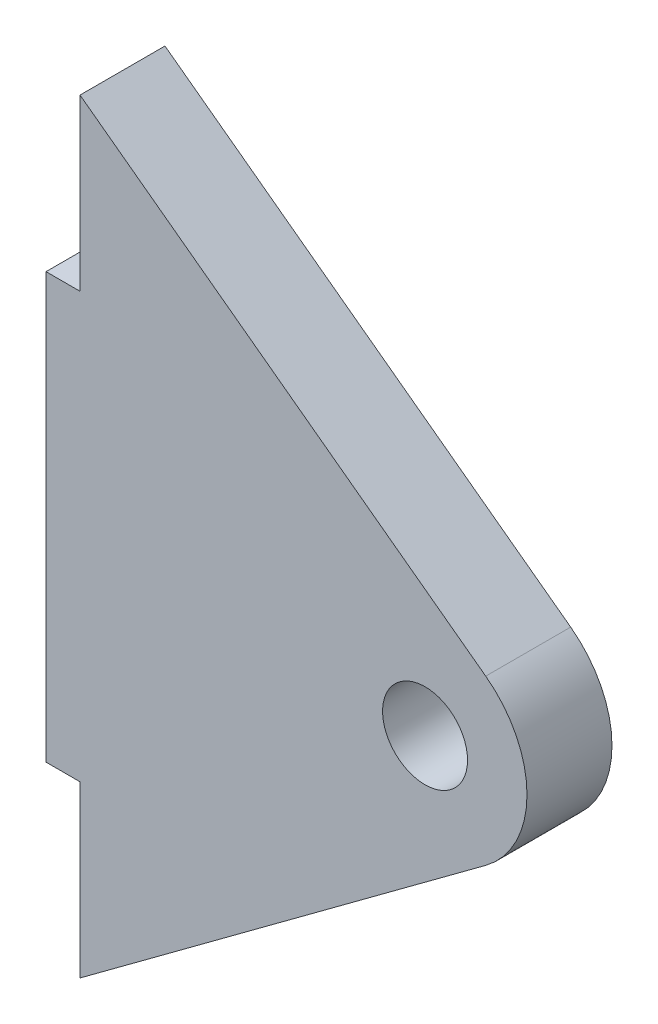
ISO-10303-21;
HEADER;
FILE_DESCRIPTION(('STEP AP214'),'2;1');
FILE_NAME('part.step','',(''),(''),'','','');
FILE_SCHEMA(('AUTOMOTIVE_DESIGN { 1 0 10303 214 1 1 1 1 }'));
ENDSEC;
DATA;
#1=APPLICATION_CONTEXT('core data for automotive mechanical design processes');
#2=APPLICATION_PROTOCOL_DEFINITION('international standard','automotive_design',2000,#1);
#3=PRODUCT_CONTEXT('',#1,'mechanical');
#4=PRODUCT('Part','Part','',(#3));
#5=PRODUCT_RELATED_PRODUCT_CATEGORY('part','',(#4));
#6=PRODUCT_DEFINITION_FORMATION('','',#4);
#7=PRODUCT_DEFINITION_CONTEXT('part definition',#1,'design');
#8=PRODUCT_DEFINITION('design','',#6,#7);
#9=PRODUCT_DEFINITION_SHAPE('','',#8);
#10=(LENGTH_UNIT() NAMED_UNIT(*) SI_UNIT(.MILLI.,.METRE.));
#11=(NAMED_UNIT(*) PLANE_ANGLE_UNIT() SI_UNIT($,.RADIAN.));
#12=(NAMED_UNIT(*) SI_UNIT($,.STERADIAN.) SOLID_ANGLE_UNIT());
#13=UNCERTAINTY_MEASURE_WITH_UNIT(LENGTH_MEASURE(1.E-05),#10,'distance_accuracy_value','');
#14=(GEOMETRIC_REPRESENTATION_CONTEXT(3) GLOBAL_UNCERTAINTY_ASSIGNED_CONTEXT((#13)) GLOBAL_UNIT_ASSIGNED_CONTEXT((#10,
#11,#12)) REPRESENTATION_CONTEXT('',''));
#15=CARTESIAN_POINT('',(0.,0.,0.));
#16=DIRECTION('',(0.,0.,1.));
#17=DIRECTION('',(1.,0.,0.));
#18=AXIS2_PLACEMENT_3D('',#15,#16,#17);
#19=CARTESIAN_POINT('',(210.781303050667,212.057553234732,-5.));
#20=DIRECTION('',(0.,0.,1.));
#21=DIRECTION('',(-1.,0.,0.));
#22=AXIS2_PLACEMENT_3D('',#19,#20,#21);
#23=CYLINDRICAL_SURFACE('',#22,6.);
#24=CARTESIAN_POINT('',(210.781303050667,212.057553234732,0.));
#25=DIRECTION('',(0.,0.,1.));
#26=DIRECTION('',(1.,0.,0.));
#27=AXIS2_PLACEMENT_3D('',#24,#25,#26);
#28=CIRCLE('',#27,6.);
#29=CARTESIAN_POINT('',(214.351594971474,216.879691308265,0.));
#30=VERTEX_POINT('',#29);
#31=CARTESIAN_POINT('',(214.351594971474,207.235415161199,0.));
#32=VERTEX_POINT('',#31);
#33=EDGE_CURVE('E140',#30,#32,#28,.F.);
#34=ORIENTED_EDGE('',*,*,#33,.T.);
#35=DIRECTION('',(0.,0.,1.));
#36=VECTOR('',#35,1.);
#37=CARTESIAN_POINT('',(214.351594971474,207.235415161199,-5.));
#38=LINE('',#37,#36);
#39=CARTESIAN_POINT('',(214.351594971474,207.235415161199,-5.));
#40=VERTEX_POINT('',#39);
#41=EDGE_CURVE('E139',#40,#32,#38,.T.);
#42=ORIENTED_EDGE('',*,*,#41,.F.);
#43=CARTESIAN_POINT('',(210.781303050667,212.057553234732,-5.));
#44=DIRECTION('',(0.,0.,1.));
#45=DIRECTION('',(1.,0.,0.));
#46=AXIS2_PLACEMENT_3D('',#43,#44,#45);
#47=CIRCLE('',#46,6.);
#48=CARTESIAN_POINT('',(214.351594971474,216.879691308265,-5.));
#49=VERTEX_POINT('',#48);
#50=EDGE_CURVE('E159',#49,#40,#47,.F.);
#51=ORIENTED_EDGE('',*,*,#50,.F.);
#52=DIRECTION('',(0.,0.,1.));
#53=VECTOR('',#52,1.);
#54=CARTESIAN_POINT('',(214.351594971474,216.879691308265,-5.));
#55=LINE('',#54,#53);
#56=EDGE_CURVE('E11',#49,#30,#55,.T.);
#57=ORIENTED_EDGE('',*,*,#56,.T.);
#58=EDGE_LOOP('',(#34,#42,#51,#57));
#59=FACE_BOUND('',#58,.T.);
#60=ADVANCED_FACE('F39',(#59),#23,.T.);
#61=CARTESIAN_POINT('',(179.617576694411,242.596620799026,-5.));
#62=DIRECTION('',(0.595048653467869,0.803689678922204,0.));
#63=DIRECTION('',(-0.803689678922204,0.595048653467869,0.));
#64=AXIS2_PLACEMENT_3D('',#61,#62,#63);
#65=PLANE('',#64);
#66=DIRECTION('',(0.803689678922204,-0.595048653467869,0.));
#67=VECTOR('',#66,1.);
#68=CARTESIAN_POINT('',(179.617576694411,242.596620799026,0.));
#69=LINE('',#68,#67);
#70=CARTESIAN_POINT('',(190.475370577193,234.557553234732,0.));
#71=VERTEX_POINT('',#70);
#72=EDGE_CURVE('E143',#71,#30,#69,.T.);
#73=ORIENTED_EDGE('',*,*,#72,.T.);
#74=ORIENTED_EDGE('',*,*,#56,.F.);
#75=DIRECTION('',(0.803689678922204,-0.595048653467869,0.));
#76=VECTOR('',#75,1.);
#77=CARTESIAN_POINT('',(179.617576694411,242.596620799026,-5.));
#78=LINE('',#77,#76);
#79=CARTESIAN_POINT('',(190.475370577193,234.557553234732,-5.));
#80=VERTEX_POINT('',#79);
#81=EDGE_CURVE('E93',#80,#49,#78,.T.);
#82=ORIENTED_EDGE('',*,*,#81,.F.);
#83=DIRECTION('',(0.,0.,1.));
#84=VECTOR('',#83,1.);
#85=CARTESIAN_POINT('',(190.475370577193,234.557553234732,-5.));
#86=LINE('',#85,#84);
#87=EDGE_CURVE('E47',#80,#71,#86,.T.);
#88=ORIENTED_EDGE('',*,*,#87,.T.);
#89=EDGE_LOOP('',(#73,#74,#82,#88));
#90=FACE_BOUND('',#89,.T.);
#91=ADVANCED_FACE('F172',(#90),#65,.T.);
#92=CARTESIAN_POINT('',(190.475370577193,0.,-5.));
#93=DIRECTION('',(-1.,0.,0.));
#94=DIRECTION('',(0.,0.,-1.));
#95=AXIS2_PLACEMENT_3D('',#92,#93,#94);
#96=PLANE('',#95);
#97=DIRECTION('',(0.,1.,0.));
#98=VECTOR('',#97,1.);
#99=CARTESIAN_POINT('',(190.475370577193,0.,0.));
#100=LINE('',#99,#98);
#101=CARTESIAN_POINT('',(190.475370577193,224.557553234732,0.));
#102=VERTEX_POINT('',#101);
#103=EDGE_CURVE('E145',#102,#71,#100,.T.);
#104=ORIENTED_EDGE('',*,*,#103,.T.);
#105=ORIENTED_EDGE('',*,*,#87,.F.);
#106=DIRECTION('',(0.,1.,0.));
#107=VECTOR('',#106,1.);
#108=CARTESIAN_POINT('',(190.475370577193,0.,-5.));
#109=LINE('',#108,#107);
#110=CARTESIAN_POINT('',(190.475370577193,224.557553234732,-5.));
#111=VERTEX_POINT('',#110);
#112=EDGE_CURVE('E116',#111,#80,#109,.T.);
#113=ORIENTED_EDGE('',*,*,#112,.F.);
#114=DIRECTION('',(0.,0.,1.));
#115=VECTOR('',#114,1.);
#116=CARTESIAN_POINT('',(190.475370577193,224.557553234732,-5.));
#117=LINE('',#116,#115);
#118=EDGE_CURVE('E166',#111,#102,#117,.T.);
#119=ORIENTED_EDGE('',*,*,#118,.T.);
#120=EDGE_LOOP('',(#104,#105,#113,#119));
#121=FACE_BOUND('',#120,.T.);
#122=ADVANCED_FACE('F190',(#121),#96,.T.);
#123=CARTESIAN_POINT('',(0.,224.557553234732,-5.));
#124=DIRECTION('',(0.,-1.,0.));
#125=DIRECTION('',(0.,0.,1.));
#126=AXIS2_PLACEMENT_3D('',#123,#124,#125);
#127=PLANE('',#126);
#128=DIRECTION('',(-1.,0.,0.));
#129=VECTOR('',#128,1.);
#130=CARTESIAN_POINT('',(0.,224.557553234732,0.));
#131=LINE('',#130,#129);
#132=CARTESIAN_POINT('',(188.475370577193,224.557553234732,0.));
#133=VERTEX_POINT('',#132);
#134=EDGE_CURVE('E147',#102,#133,#131,.T.);
#135=ORIENTED_EDGE('',*,*,#134,.F.);
#136=ORIENTED_EDGE('',*,*,#118,.F.);
#137=DIRECTION('',(-1.,0.,0.));
#138=VECTOR('',#137,1.);
#139=CARTESIAN_POINT('',(0.,224.557553234732,-5.));
#140=LINE('',#139,#138);
#141=CARTESIAN_POINT('',(188.475370577193,224.557553234732,-5.));
#142=VERTEX_POINT('',#141);
#143=EDGE_CURVE('E131',#111,#142,#140,.T.);
#144=ORIENTED_EDGE('',*,*,#143,.T.);
#145=DIRECTION('',(0.,0.,1.));
#146=VECTOR('',#145,1.);
#147=CARTESIAN_POINT('',(188.475370577193,224.557553234732,-5.));
#148=LINE('',#147,#146);
#149=EDGE_CURVE('E163',#142,#133,#148,.T.);
#150=ORIENTED_EDGE('',*,*,#149,.T.);
#151=EDGE_LOOP('',(#135,#136,#144,#150));
#152=FACE_BOUND('',#151,.T.);
#153=ADVANCED_FACE('F186',(#152),#127,.F.);
#154=CARTESIAN_POINT('',(188.475370577193,0.,-5.));
#155=DIRECTION('',(1.,0.,0.));
#156=DIRECTION('',(0.,0.,1.));
#157=AXIS2_PLACEMENT_3D('',#154,#155,#156);
#158=PLANE('',#157);
#159=DIRECTION('',(0.,-1.,0.));
#160=VECTOR('',#159,1.);
#161=CARTESIAN_POINT('',(188.475370577193,0.,0.));
#162=LINE('',#161,#160);
#163=CARTESIAN_POINT('',(188.475370577193,199.557553234732,0.));
#164=VERTEX_POINT('',#163);
#165=EDGE_CURVE('E150',#133,#164,#162,.T.);
#166=ORIENTED_EDGE('',*,*,#165,.F.);
#167=ORIENTED_EDGE('',*,*,#149,.F.);
#168=DIRECTION('',(0.,-1.,0.));
#169=VECTOR('',#168,1.);
#170=CARTESIAN_POINT('',(188.475370577193,0.,-5.));
#171=LINE('',#170,#169);
#172=CARTESIAN_POINT('',(188.475370577193,199.557553234732,-5.));
#173=VERTEX_POINT('',#172);
#174=EDGE_CURVE('E129',#142,#173,#171,.T.);
#175=ORIENTED_EDGE('',*,*,#174,.T.);
#176=DIRECTION('',(0.,0.,1.));
#177=VECTOR('',#176,1.);
#178=CARTESIAN_POINT('',(188.475370577193,199.557553234732,-5.));
#179=LINE('',#178,#177);
#180=EDGE_CURVE('E123',#173,#164,#179,.T.);
#181=ORIENTED_EDGE('',*,*,#180,.T.);
#182=EDGE_LOOP('',(#166,#167,#175,#181));
#183=FACE_BOUND('',#182,.T.);
#184=ADVANCED_FACE('F189',(#183),#158,.F.);
#185=CARTESIAN_POINT('',(0.,199.557553234732,-5.));
#186=DIRECTION('',(0.,1.,0.));
#187=DIRECTION('',(0.,0.,-1.));
#188=AXIS2_PLACEMENT_3D('',#185,#186,#187);
#189=PLANE('',#188);
#190=DIRECTION('',(1.,0.,0.));
#191=VECTOR('',#190,1.);
#192=CARTESIAN_POINT('',(0.,199.557553234732,0.));
#193=LINE('',#192,#191);
#194=CARTESIAN_POINT('',(190.475370577193,199.557553234732,0.));
#195=VERTEX_POINT('',#194);
#196=EDGE_CURVE('E153',#164,#195,#193,.T.);
#197=ORIENTED_EDGE('',*,*,#196,.F.);
#198=ORIENTED_EDGE('',*,*,#180,.F.);
#199=DIRECTION('',(1.,0.,0.));
#200=VECTOR('',#199,1.);
#201=CARTESIAN_POINT('',(0.,199.557553234732,-5.));
#202=LINE('',#201,#200);
#203=CARTESIAN_POINT('',(190.475370577193,199.557553234732,-5.));
#204=VERTEX_POINT('',#203);
#205=EDGE_CURVE('E112',#173,#204,#202,.T.);
#206=ORIENTED_EDGE('',*,*,#205,.T.);
#207=DIRECTION('',(0.,0.,1.));
#208=VECTOR('',#207,1.);
#209=CARTESIAN_POINT('',(190.475370577193,199.557553234732,-5.));
#210=LINE('',#209,#208);
#211=EDGE_CURVE('E118',#204,#195,#210,.T.);
#212=ORIENTED_EDGE('',*,*,#211,.T.);
#213=EDGE_LOOP('',(#197,#198,#206,#212));
#214=FACE_BOUND('',#213,.T.);
#215=ADVANCED_FACE('F126',(#214),#189,.F.);
#216=CARTESIAN_POINT('',(190.475370577193,189.557553234732,0.));
#217=VERTEX_POINT('',#216);
#218=EDGE_CURVE('E120',#217,#195,#100,.T.);
#219=ORIENTED_EDGE('',*,*,#218,.T.);
#220=ORIENTED_EDGE('',*,*,#211,.F.);
#221=CARTESIAN_POINT('',(190.475370577193,189.557553234732,-5.));
#222=VERTEX_POINT('',#221);
#223=EDGE_CURVE('E107',#222,#204,#109,.T.);
#224=ORIENTED_EDGE('',*,*,#223,.F.);
#225=DIRECTION('',(0.,0.,1.));
#226=VECTOR('',#225,1.);
#227=CARTESIAN_POINT('',(190.475370577193,189.557553234732,-5.));
#228=LINE('',#227,#226);
#229=EDGE_CURVE('E124',#222,#217,#228,.T.);
#230=ORIENTED_EDGE('',*,*,#229,.T.);
#231=EDGE_LOOP('',(#219,#220,#224,#230));
#232=FACE_BOUND('',#231,.T.);
#233=ADVANCED_FACE('F119',(#232),#96,.T.);
#234=CARTESIAN_POINT('',(-23.2088827554402,31.3465788404982,-5.));
#235=DIRECTION('',(0.595048653467869,-0.803689678922204,0.));
#236=DIRECTION('',(0.803689678922204,0.595048653467869,0.));
#237=AXIS2_PLACEMENT_3D('',#234,#235,#236);
#238=PLANE('',#237);
#239=DIRECTION('',(-0.803689678922204,-0.595048653467869,0.));
#240=VECTOR('',#239,1.);
#241=CARTESIAN_POINT('',(-23.2088827554402,31.3465788404982,0.));
#242=LINE('',#241,#240);
#243=EDGE_CURVE('E81',#32,#217,#242,.T.);
#244=ORIENTED_EDGE('',*,*,#243,.T.);
#245=ORIENTED_EDGE('',*,*,#229,.F.);
#246=DIRECTION('',(-0.803689678922204,-0.595048653467869,0.));
#247=VECTOR('',#246,1.);
#248=CARTESIAN_POINT('',(-23.2088827554402,31.3465788404982,-5.));
#249=LINE('',#248,#247);
#250=EDGE_CURVE('E55',#40,#222,#249,.T.);
#251=ORIENTED_EDGE('',*,*,#250,.F.);
#252=ORIENTED_EDGE('',*,*,#41,.T.);
#253=EDGE_LOOP('',(#244,#245,#251,#252));
#254=FACE_BOUND('',#253,.T.);
#255=ADVANCED_FACE('F201',(#254),#238,.T.);
#256=CARTESIAN_POINT('',(210.781303050667,212.057553234732,-5.));
#257=DIRECTION('',(0.,0.,1.));
#258=DIRECTION('',(-1.,0.,0.));
#259=AXIS2_PLACEMENT_3D('',#256,#257,#258);
#260=CYLINDRICAL_SURFACE('',#259,2.5);
#261=CARTESIAN_POINT('',(210.781303050667,212.057553234732,-5.));
#262=DIRECTION('',(0.,0.,1.));
#263=DIRECTION('',(1.,0.,0.));
#264=AXIS2_PLACEMENT_3D('',#261,#262,#263);
#265=CIRCLE('',#264,2.5);
#266=CARTESIAN_POINT('',(213.281303050667,212.057553234732,-5.));
#267=VERTEX_POINT('',#266);
#268=EDGE_CURVE('E136',#267,#267,#265,.T.);
#269=ORIENTED_EDGE('',*,*,#268,.F.);
#270=EDGE_LOOP('',(#269));
#271=FACE_BOUND('',#270,.T.);
#272=CARTESIAN_POINT('',(210.781303050667,212.057553234732,0.));
#273=DIRECTION('',(0.,0.,1.));
#274=DIRECTION('',(1.,0.,0.));
#275=AXIS2_PLACEMENT_3D('',#272,#273,#274);
#276=CIRCLE('',#275,2.5);
#277=CARTESIAN_POINT('',(213.281303050667,212.057553234732,0.));
#278=VERTEX_POINT('',#277);
#279=EDGE_CURVE('E156',#278,#278,#276,.T.);
#280=ORIENTED_EDGE('',*,*,#279,.T.);
#281=EDGE_LOOP('',(#280));
#282=FACE_BOUND('',#281,.T.);
#283=ADVANCED_FACE('F253',(#271,#282),#260,.F.);
#284=CARTESIAN_POINT('',(0.,0.,-5.));
#285=DIRECTION('',(0.,0.,-1.));
#286=DIRECTION('',(1.,0.,0.));
#287=AXIS2_PLACEMENT_3D('',#284,#285,#286);
#288=PLANE('',#287);
#289=ORIENTED_EDGE('',*,*,#50,.T.);
#290=ORIENTED_EDGE('',*,*,#250,.T.);
#291=ORIENTED_EDGE('',*,*,#223,.T.);
#292=ORIENTED_EDGE('',*,*,#205,.F.);
#293=ORIENTED_EDGE('',*,*,#174,.F.);
#294=ORIENTED_EDGE('',*,*,#143,.F.);
#295=ORIENTED_EDGE('',*,*,#112,.T.);
#296=ORIENTED_EDGE('',*,*,#81,.T.);
#297=EDGE_LOOP('',(#289,#290,#291,#292,#293,#294,#295,#296));
#298=FACE_BOUND('',#297,.T.);
#299=ORIENTED_EDGE('',*,*,#268,.T.);
#300=EDGE_LOOP('',(#299));
#301=FACE_BOUND('',#300,.T.);
#302=ADVANCED_FACE('F109',(#298,#301),#288,.T.);
#303=CARTESIAN_POINT('',(0.,0.,0.));
#304=DIRECTION('',(0.,0.,-1.));
#305=DIRECTION('',(1.,0.,0.));
#306=AXIS2_PLACEMENT_3D('',#303,#304,#305);
#307=PLANE('',#306);
#308=ORIENTED_EDGE('',*,*,#33,.F.);
#309=ORIENTED_EDGE('',*,*,#72,.F.);
#310=ORIENTED_EDGE('',*,*,#103,.F.);
#311=ORIENTED_EDGE('',*,*,#134,.T.);
#312=ORIENTED_EDGE('',*,*,#165,.T.);
#313=ORIENTED_EDGE('',*,*,#196,.T.);
#314=ORIENTED_EDGE('',*,*,#218,.F.);
#315=ORIENTED_EDGE('',*,*,#243,.F.);
#316=EDGE_LOOP('',(#308,#309,#310,#311,#312,#313,#314,#315));
#317=FACE_BOUND('',#316,.T.);
#318=ORIENTED_EDGE('',*,*,#279,.F.);
#319=EDGE_LOOP('',(#318));
#320=FACE_BOUND('',#319,.T.);
#321=ADVANCED_FACE('F176',(#317,#320),#307,.F.);
#322=CLOSED_SHELL('',(#60,#91,#122,#153,#184,#215,#233,#255,#283,#302,#321));
#323=MANIFOLD_SOLID_BREP('B2',#322);
#324=ADVANCED_BREP_SHAPE_REPRESENTATION('',(#18,#323),#14);
#325=SHAPE_DEFINITION_REPRESENTATION(#9,#324);
ENDSEC;
END-ISO-10303-21;
